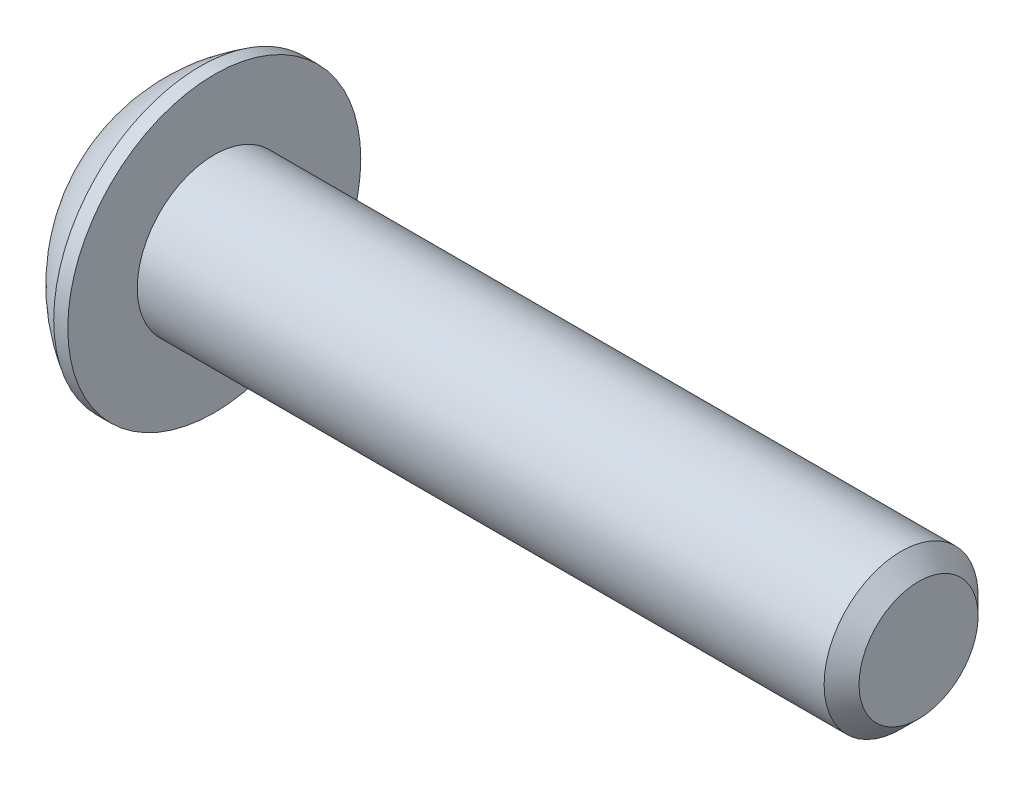
ISO-10303-21;
HEADER;
FILE_DESCRIPTION(('STEP AP214'),'2;1');
FILE_NAME('part.step','',(''),(''),'','','');
FILE_SCHEMA(('AUTOMOTIVE_DESIGN { 1 0 10303 214 1 1 1 1 }'));
ENDSEC;
DATA;
#1=APPLICATION_CONTEXT('core data for automotive mechanical design processes');
#2=APPLICATION_PROTOCOL_DEFINITION('international standard','automotive_design',2000,#1);
#3=PRODUCT_CONTEXT('',#1,'mechanical');
#4=PRODUCT('Part','Part','',(#3));
#5=PRODUCT_RELATED_PRODUCT_CATEGORY('part','',(#4));
#6=PRODUCT_DEFINITION_FORMATION('','',#4);
#7=PRODUCT_DEFINITION_CONTEXT('part definition',#1,'design');
#8=PRODUCT_DEFINITION('design','',#6,#7);
#9=PRODUCT_DEFINITION_SHAPE('','',#8);
#10=(LENGTH_UNIT() NAMED_UNIT(*) SI_UNIT(.MILLI.,.METRE.));
#11=(NAMED_UNIT(*) PLANE_ANGLE_UNIT() SI_UNIT($,.RADIAN.));
#12=(NAMED_UNIT(*) SI_UNIT($,.STERADIAN.) SOLID_ANGLE_UNIT());
#13=UNCERTAINTY_MEASURE_WITH_UNIT(LENGTH_MEASURE(1.E-05),#10,'distance_accuracy_value','');
#14=(GEOMETRIC_REPRESENTATION_CONTEXT(3) GLOBAL_UNCERTAINTY_ASSIGNED_CONTEXT((#13)) GLOBAL_UNIT_ASSIGNED_CONTEXT((#10,
#11,#12)) REPRESENTATION_CONTEXT('',''));
#15=CARTESIAN_POINT('',(0.,0.,0.));
#16=DIRECTION('',(0.,0.,1.));
#17=DIRECTION('',(1.,0.,0.));
#18=AXIS2_PLACEMENT_3D('',#15,#16,#17);
#19=CARTESIAN_POINT('',(1.32080000000034,0.,0.));
#20=DIRECTION('',(-1.,0.,0.));
#21=DIRECTION('',(0.,0.,1.));
#22=AXIS2_PLACEMENT_3D('',#19,#20,#21);
#23=CONICAL_SURFACE('',#22,1.1937999999998,1.04719755119608);
#24=CARTESIAN_POINT('',(2.01004075135902,0.,4.44089209850063E-13));
#25=VERTEX_POINT('',#24);
#26=VERTEX_LOOP('',#25);
#27=FACE_BOUND('',#26,.T.);
#28=CARTESIAN_POINT('',(1.32080000000009,0.,0.));
#29=DIRECTION('',(-1.,0.,0.));
#30=DIRECTION('',(0.,0.,1.));
#31=AXIS2_PLACEMENT_3D('',#28,#29,#30);
#32=CIRCLE('',#31,1.19380000000024);
#33=CARTESIAN_POINT('',(1.32080000000004,-1.03386112703797,0.59690000000006));
#34=VERTEX_POINT('',#33);
#35=CARTESIAN_POINT('',(1.32080000000004,0.,1.19380000000012));
#36=VERTEX_POINT('',#35);
#37=EDGE_CURVE('E18',#34,#36,#32,.T.);
#38=ORIENTED_EDGE('',*,*,#37,.T.);
#39=CARTESIAN_POINT('',(1.32080000000009,0.,0.));
#40=DIRECTION('',(-1.,0.,0.));
#41=DIRECTION('',(0.,0.,1.));
#42=AXIS2_PLACEMENT_3D('',#39,#40,#41);
#43=CIRCLE('',#42,1.19380000000024);
#44=CARTESIAN_POINT('',(1.32080000000004,1.03386112703797,0.596900000000061));
#45=VERTEX_POINT('',#44);
#46=EDGE_CURVE('E146',#36,#45,#43,.T.);
#47=ORIENTED_EDGE('',*,*,#46,.T.);
#48=CARTESIAN_POINT('',(1.32080000000009,0.,0.));
#49=DIRECTION('',(-1.,0.,0.));
#50=DIRECTION('',(0.,0.,1.));
#51=AXIS2_PLACEMENT_3D('',#48,#49,#50);
#52=CIRCLE('',#51,1.19380000000024);
#53=CARTESIAN_POINT('',(1.32080000000004,1.03386112703797,-0.596900000000061));
#54=VERTEX_POINT('',#53);
#55=EDGE_CURVE('E316',#45,#54,#52,.T.);
#56=ORIENTED_EDGE('',*,*,#55,.T.);
#57=CARTESIAN_POINT('',(1.32080000000009,0.,0.));
#58=DIRECTION('',(-1.,0.,0.));
#59=DIRECTION('',(0.,0.,1.));
#60=AXIS2_PLACEMENT_3D('',#57,#58,#59);
#61=CIRCLE('',#60,1.19380000000024);
#62=CARTESIAN_POINT('',(1.32080000000004,1.49457637585666E-12,-1.19380000000012));
#63=VERTEX_POINT('',#62);
#64=EDGE_CURVE('E317',#54,#63,#61,.T.);
#65=ORIENTED_EDGE('',*,*,#64,.T.);
#66=CARTESIAN_POINT('',(1.32080000000009,0.,0.));
#67=DIRECTION('',(-1.,0.,0.));
#68=DIRECTION('',(0.,0.,1.));
#69=AXIS2_PLACEMENT_3D('',#66,#67,#68);
#70=CIRCLE('',#69,1.19380000000024);
#71=CARTESIAN_POINT('',(1.32080000000004,-1.03386112703797,-0.59690000000006));
#72=VERTEX_POINT('',#71);
#73=EDGE_CURVE('E91',#63,#72,#70,.T.);
#74=ORIENTED_EDGE('',*,*,#73,.T.);
#75=CARTESIAN_POINT('',(1.32080000000009,0.,0.));
#76=DIRECTION('',(-1.,0.,0.));
#77=DIRECTION('',(0.,0.,1.));
#78=AXIS2_PLACEMENT_3D('',#75,#76,#77);
#79=CIRCLE('',#78,1.19380000000024);
#80=EDGE_CURVE('E87',#72,#34,#79,.T.);
#81=ORIENTED_EDGE('',*,*,#80,.T.);
#82=EDGE_LOOP('',(#38,#47,#56,#65,#74,#81));
#83=FACE_BOUND('',#82,.T.);
#84=ADVANCED_FACE('F15',(#27,#83),#23,.F.);
#85=CARTESIAN_POINT('',(1.3208,-2.06772225407572,-1.1938));
#86=DIRECTION('',(1.,0.,0.));
#87=DIRECTION('',(0.,0.,-1.));
#88=AXIS2_PLACEMENT_3D('',#85,#86,#87);
#89=PLANE('',#88);
#90=DIRECTION('',(0.,0.5,0.866025403784439));
#91=VECTOR('',#90,1.);
#92=CARTESIAN_POINT('',(1.3208,-1.37848150271715,0.));
#93=LINE('',#92,#91);
#94=CARTESIAN_POINT('',(1.3208,-0.689240751358574,1.1938));
#95=VERTEX_POINT('',#94);
#96=EDGE_CURVE('E99',#95,#34,#93,.F.);
#97=ORIENTED_EDGE('',*,*,#96,.F.);
#98=DIRECTION('',(0.,1.,0.));
#99=VECTOR('',#98,1.);
#100=CARTESIAN_POINT('',(1.3208,-0.689240751358574,1.1938));
#101=LINE('',#100,#99);
#102=EDGE_CURVE('E101',#36,#95,#101,.F.);
#103=ORIENTED_EDGE('',*,*,#102,.F.);
#104=ORIENTED_EDGE('',*,*,#37,.F.);
#105=EDGE_LOOP('',(#97,#103,#104));
#106=FACE_BOUND('',#105,.T.);
#107=ADVANCED_FACE('F97',(#106),#89,.F.);
#108=CARTESIAN_POINT('',(1.3208,-2.06772225407572,-1.1938));
#109=DIRECTION('',(1.,0.,0.));
#110=DIRECTION('',(0.,0.,-1.));
#111=AXIS2_PLACEMENT_3D('',#108,#109,#110);
#112=PLANE('',#111);
#113=DIRECTION('',(0.,-0.5,0.866025403784439));
#114=VECTOR('',#113,1.);
#115=CARTESIAN_POINT('',(1.3208,-0.689240751358574,-1.1938));
#116=LINE('',#115,#114);
#117=CARTESIAN_POINT('',(1.3208,-1.37848150271715,0.));
#118=VERTEX_POINT('',#117);
#119=EDGE_CURVE('E107',#118,#72,#116,.F.);
#120=ORIENTED_EDGE('',*,*,#119,.F.);
#121=DIRECTION('',(0.,0.5,0.866025403784439));
#122=VECTOR('',#121,1.);
#123=CARTESIAN_POINT('',(1.3208,-1.37848150271715,0.));
#124=LINE('',#123,#122);
#125=EDGE_CURVE('E104',#34,#118,#124,.F.);
#126=ORIENTED_EDGE('',*,*,#125,.F.);
#127=ORIENTED_EDGE('',*,*,#80,.F.);
#128=EDGE_LOOP('',(#120,#126,#127));
#129=FACE_BOUND('',#128,.T.);
#130=ADVANCED_FACE('F105',(#129),#112,.F.);
#131=CARTESIAN_POINT('',(1.3208,-2.06772225407572,-1.1938));
#132=DIRECTION('',(1.,0.,0.));
#133=DIRECTION('',(0.,0.,-1.));
#134=AXIS2_PLACEMENT_3D('',#131,#132,#133);
#135=PLANE('',#134);
#136=DIRECTION('',(0.,1.,0.));
#137=VECTOR('',#136,1.);
#138=CARTESIAN_POINT('',(1.3208,0.689240751358577,-1.1938));
#139=LINE('',#138,#137);
#140=CARTESIAN_POINT('',(1.3208,-0.689240751358574,-1.1938));
#141=VERTEX_POINT('',#140);
#142=EDGE_CURVE('E286',#141,#63,#139,.T.);
#143=ORIENTED_EDGE('',*,*,#142,.F.);
#144=DIRECTION('',(0.,-0.5,0.866025403784439));
#145=VECTOR('',#144,1.);
#146=CARTESIAN_POINT('',(1.3208,-0.689240751358574,-1.1938));
#147=LINE('',#146,#145);
#148=EDGE_CURVE('E298',#72,#141,#147,.F.);
#149=ORIENTED_EDGE('',*,*,#148,.F.);
#150=ORIENTED_EDGE('',*,*,#73,.F.);
#151=EDGE_LOOP('',(#143,#149,#150));
#152=FACE_BOUND('',#151,.T.);
#153=ADVANCED_FACE('F189',(#152),#135,.F.);
#154=CARTESIAN_POINT('',(1.3208,-2.06772225407572,-1.1938));
#155=DIRECTION('',(1.,0.,0.));
#156=DIRECTION('',(0.,0.,-1.));
#157=AXIS2_PLACEMENT_3D('',#154,#155,#156);
#158=PLANE('',#157);
#159=DIRECTION('',(0.,-0.5,-0.866025403784439));
#160=VECTOR('',#159,1.);
#161=CARTESIAN_POINT('',(1.3208,1.37848150271715,0.));
#162=LINE('',#161,#160);
#163=CARTESIAN_POINT('',(1.3208,0.689240751358577,-1.1938));
#164=VERTEX_POINT('',#163);
#165=EDGE_CURVE('E272',#164,#54,#162,.F.);
#166=ORIENTED_EDGE('',*,*,#165,.F.);
#167=DIRECTION('',(0.,1.,0.));
#168=VECTOR('',#167,1.);
#169=CARTESIAN_POINT('',(1.3208,0.689240751358577,-1.1938));
#170=LINE('',#169,#168);
#171=EDGE_CURVE('E283',#63,#164,#170,.T.);
#172=ORIENTED_EDGE('',*,*,#171,.F.);
#173=ORIENTED_EDGE('',*,*,#64,.F.);
#174=EDGE_LOOP('',(#166,#172,#173));
#175=FACE_BOUND('',#174,.T.);
#176=ADVANCED_FACE('F185',(#175),#158,.F.);
#177=CARTESIAN_POINT('',(1.3208,-2.06772225407572,-1.1938));
#178=DIRECTION('',(1.,0.,0.));
#179=DIRECTION('',(0.,0.,-1.));
#180=AXIS2_PLACEMENT_3D('',#177,#178,#179);
#181=PLANE('',#180);
#182=DIRECTION('',(0.,0.5,-0.866025403784439));
#183=VECTOR('',#182,1.);
#184=CARTESIAN_POINT('',(1.3208,0.689240751358576,1.1938));
#185=LINE('',#184,#183);
#186=CARTESIAN_POINT('',(1.3208,1.37848150271715,0.));
#187=VERTEX_POINT('',#186);
#188=EDGE_CURVE('E251',#187,#45,#185,.F.);
#189=ORIENTED_EDGE('',*,*,#188,.F.);
#190=DIRECTION('',(0.,-0.5,-0.866025403784439));
#191=VECTOR('',#190,1.);
#192=CARTESIAN_POINT('',(1.3208,1.37848150271715,0.));
#193=LINE('',#192,#191);
#194=EDGE_CURVE('E270',#54,#187,#193,.F.);
#195=ORIENTED_EDGE('',*,*,#194,.F.);
#196=ORIENTED_EDGE('',*,*,#55,.F.);
#197=EDGE_LOOP('',(#189,#195,#196));
#198=FACE_BOUND('',#197,.T.);
#199=ADVANCED_FACE('F181',(#198),#181,.F.);
#200=CARTESIAN_POINT('',(1.3208,-2.06772225407572,-1.1938));
#201=DIRECTION('',(1.,0.,0.));
#202=DIRECTION('',(0.,0.,-1.));
#203=AXIS2_PLACEMENT_3D('',#200,#201,#202);
#204=PLANE('',#203);
#205=DIRECTION('',(0.,1.,0.));
#206=VECTOR('',#205,1.);
#207=CARTESIAN_POINT('',(1.3208,-0.689240751358574,1.1938));
#208=LINE('',#207,#206);
#209=CARTESIAN_POINT('',(1.3208,0.689240751358576,1.1938));
#210=VERTEX_POINT('',#209);
#211=EDGE_CURVE('E116',#210,#36,#208,.F.);
#212=ORIENTED_EDGE('',*,*,#211,.F.);
#213=DIRECTION('',(0.,0.5,-0.866025403784439));
#214=VECTOR('',#213,1.);
#215=CARTESIAN_POINT('',(1.3208,0.689240751358576,1.1938));
#216=LINE('',#215,#214);
#217=EDGE_CURVE('E254',#45,#210,#216,.F.);
#218=ORIENTED_EDGE('',*,*,#217,.F.);
#219=ORIENTED_EDGE('',*,*,#46,.F.);
#220=EDGE_LOOP('',(#212,#218,#219));
#221=FACE_BOUND('',#220,.T.);
#222=ADVANCED_FACE('F177',(#221),#204,.F.);
#223=CARTESIAN_POINT('',(1.3208,-0.689240751358574,1.1938));
#224=DIRECTION('',(0.,0.,-1.));
#225=DIRECTION('',(0.,1.,0.));
#226=AXIS2_PLACEMENT_3D('',#223,#224,#225);
#227=PLANE('',#226);
#228=DIRECTION('',(0.,1.,0.));
#229=VECTOR('',#228,1.);
#230=CARTESIAN_POINT('',(0.,0.,1.1938));
#231=LINE('',#230,#229);
#232=CARTESIAN_POINT('',(0.,0.689240751358577,1.1938));
#233=VERTEX_POINT('',#232);
#234=CARTESIAN_POINT('',(0.,-0.689240751358574,1.1938));
#235=VERTEX_POINT('',#234);
#236=EDGE_CURVE('E248',#233,#235,#231,.F.);
#237=ORIENTED_EDGE('',*,*,#236,.F.);
#238=DIRECTION('',(1.,0.,0.));
#239=VECTOR('',#238,1.);
#240=CARTESIAN_POINT('',(1.3208,0.689240751358576,1.1938));
#241=LINE('',#240,#239);
#242=EDGE_CURVE('E260',#210,#233,#241,.F.);
#243=ORIENTED_EDGE('',*,*,#242,.F.);
#244=ORIENTED_EDGE('',*,*,#211,.T.);
#245=ORIENTED_EDGE('',*,*,#102,.T.);
#246=DIRECTION('',(1.,0.,0.));
#247=VECTOR('',#246,1.);
#248=CARTESIAN_POINT('',(1.3208,-0.689240751358574,1.1938));
#249=LINE('',#248,#247);
#250=EDGE_CURVE('E110',#235,#95,#249,.T.);
#251=ORIENTED_EDGE('',*,*,#250,.F.);
#252=EDGE_LOOP('',(#237,#243,#244,#245,#251));
#253=FACE_BOUND('',#252,.T.);
#254=ADVANCED_FACE('F174',(#253),#227,.T.);
#255=CARTESIAN_POINT('',(1.3208,-1.37848150271715,0.));
#256=DIRECTION('',(0.,0.866025403784439,-0.5));
#257=DIRECTION('',(0.,0.5,0.866025403784439));
#258=AXIS2_PLACEMENT_3D('',#255,#256,#257);
#259=PLANE('',#258);
#260=DIRECTION('',(0.,-0.5,-0.866025403784439));
#261=VECTOR('',#260,1.);
#262=CARTESIAN_POINT('',(0.,-0.689240751358574,1.1938));
#263=LINE('',#262,#261);
#264=CARTESIAN_POINT('',(0.,-1.37848150271715,0.));
#265=VERTEX_POINT('',#264);
#266=EDGE_CURVE('E245',#235,#265,#263,.T.);
#267=ORIENTED_EDGE('',*,*,#266,.F.);
#268=ORIENTED_EDGE('',*,*,#250,.T.);
#269=ORIENTED_EDGE('',*,*,#96,.T.);
#270=ORIENTED_EDGE('',*,*,#125,.T.);
#271=DIRECTION('',(1.,0.,0.));
#272=VECTOR('',#271,1.);
#273=CARTESIAN_POINT('',(1.3208,-1.37848150271715,0.));
#274=LINE('',#273,#272);
#275=EDGE_CURVE('E295',#265,#118,#274,.T.);
#276=ORIENTED_EDGE('',*,*,#275,.F.);
#277=EDGE_LOOP('',(#267,#268,#269,#270,#276));
#278=FACE_BOUND('',#277,.T.);
#279=ADVANCED_FACE('F114',(#278),#259,.T.);
#280=CARTESIAN_POINT('',(1.3208,-0.689240751358574,-1.1938));
#281=DIRECTION('',(0.,0.866025403784439,0.5));
#282=DIRECTION('',(0.,-0.5,0.866025403784439));
#283=AXIS2_PLACEMENT_3D('',#280,#281,#282);
#284=PLANE('',#283);
#285=DIRECTION('',(0.,0.5,-0.866025403784439));
#286=VECTOR('',#285,1.);
#287=CARTESIAN_POINT('',(0.,-1.37848150271715,0.));
#288=LINE('',#287,#286);
#289=CARTESIAN_POINT('',(0.,-0.689240751358574,-1.1938));
#290=VERTEX_POINT('',#289);
#291=EDGE_CURVE('E242',#265,#290,#288,.T.);
#292=ORIENTED_EDGE('',*,*,#291,.F.);
#293=ORIENTED_EDGE('',*,*,#275,.T.);
#294=ORIENTED_EDGE('',*,*,#119,.T.);
#295=ORIENTED_EDGE('',*,*,#148,.T.);
#296=DIRECTION('',(1.,0.,0.));
#297=VECTOR('',#296,1.);
#298=CARTESIAN_POINT('',(1.3208,-0.689240751358574,-1.1938));
#299=LINE('',#298,#297);
#300=EDGE_CURVE('E280',#290,#141,#299,.T.);
#301=ORIENTED_EDGE('',*,*,#300,.F.);
#302=EDGE_LOOP('',(#292,#293,#294,#295,#301));
#303=FACE_BOUND('',#302,.T.);
#304=ADVANCED_FACE('F167',(#303),#284,.T.);
#305=CARTESIAN_POINT('',(1.3208,0.689240751358577,-1.1938));
#306=DIRECTION('',(0.,0.,1.));
#307=DIRECTION('',(1.,0.,0.));
#308=AXIS2_PLACEMENT_3D('',#305,#306,#307);
#309=PLANE('',#308);
#310=DIRECTION('',(0.,1.,0.));
#311=VECTOR('',#310,1.);
#312=CARTESIAN_POINT('',(0.,0.,-1.1938));
#313=LINE('',#312,#311);
#314=CARTESIAN_POINT('',(0.,0.689240751358577,-1.1938));
#315=VERTEX_POINT('',#314);
#316=EDGE_CURVE('E239',#290,#315,#313,.T.);
#317=ORIENTED_EDGE('',*,*,#316,.F.);
#318=ORIENTED_EDGE('',*,*,#300,.T.);
#319=ORIENTED_EDGE('',*,*,#142,.T.);
#320=ORIENTED_EDGE('',*,*,#171,.T.);
#321=DIRECTION('',(1.,0.,0.));
#322=VECTOR('',#321,1.);
#323=CARTESIAN_POINT('',(1.3208,0.689240751358577,-1.1938));
#324=LINE('',#323,#322);
#325=EDGE_CURVE('E255',#315,#164,#324,.T.);
#326=ORIENTED_EDGE('',*,*,#325,.F.);
#327=EDGE_LOOP('',(#317,#318,#319,#320,#326));
#328=FACE_BOUND('',#327,.T.);
#329=ADVANCED_FACE('F164',(#328),#309,.T.);
#330=CARTESIAN_POINT('',(1.3208,1.37848150271715,0.));
#331=DIRECTION('',(0.,-0.866025403784439,0.5));
#332=DIRECTION('',(0.,-0.5,-0.866025403784439));
#333=AXIS2_PLACEMENT_3D('',#330,#331,#332);
#334=PLANE('',#333);
#335=DIRECTION('',(0.,0.5,0.866025403784439));
#336=VECTOR('',#335,1.);
#337=CARTESIAN_POINT('',(0.,0.689240751358577,-1.1938));
#338=LINE('',#337,#336);
#339=CARTESIAN_POINT('',(0.,1.37848150271715,0.));
#340=VERTEX_POINT('',#339);
#341=EDGE_CURVE('E236',#315,#340,#338,.T.);
#342=ORIENTED_EDGE('',*,*,#341,.F.);
#343=ORIENTED_EDGE('',*,*,#325,.T.);
#344=ORIENTED_EDGE('',*,*,#165,.T.);
#345=ORIENTED_EDGE('',*,*,#194,.T.);
#346=DIRECTION('',(1.,0.,0.));
#347=VECTOR('',#346,1.);
#348=CARTESIAN_POINT('',(1.3208,1.37848150271715,0.));
#349=LINE('',#348,#347);
#350=EDGE_CURVE('E33',#340,#187,#349,.T.);
#351=ORIENTED_EDGE('',*,*,#350,.F.);
#352=EDGE_LOOP('',(#342,#343,#344,#345,#351));
#353=FACE_BOUND('',#352,.T.);
#354=ADVANCED_FACE('F160',(#353),#334,.T.);
#355=CARTESIAN_POINT('',(1.3208,0.689240751358576,1.1938));
#356=DIRECTION('',(0.,-0.866025403784439,-0.5));
#357=DIRECTION('',(0.,0.5,-0.866025403784439));
#358=AXIS2_PLACEMENT_3D('',#355,#356,#357);
#359=PLANE('',#358);
#360=DIRECTION('',(0.,-0.5,0.866025403784439));
#361=VECTOR('',#360,1.);
#362=CARTESIAN_POINT('',(0.,1.37848150271715,0.));
#363=LINE('',#362,#361);
#364=EDGE_CURVE('E145',#340,#233,#363,.T.);
#365=ORIENTED_EDGE('',*,*,#364,.F.);
#366=ORIENTED_EDGE('',*,*,#350,.T.);
#367=ORIENTED_EDGE('',*,*,#188,.T.);
#368=ORIENTED_EDGE('',*,*,#217,.T.);
#369=ORIENTED_EDGE('',*,*,#242,.T.);
#370=EDGE_LOOP('',(#365,#366,#367,#368,#369));
#371=FACE_BOUND('',#370,.T.);
#372=ADVANCED_FACE('F156',(#371),#359,.T.);
#373=CARTESIAN_POINT('',(0.,0.,0.));
#374=DIRECTION('',(-1.,0.,0.));
#375=DIRECTION('',(0.,0.,1.));
#376=AXIS2_PLACEMENT_3D('',#373,#374,#375);
#377=PLANE('',#376);
#378=ORIENTED_EDGE('',*,*,#341,.T.);
#379=ORIENTED_EDGE('',*,*,#364,.T.);
#380=ORIENTED_EDGE('',*,*,#236,.T.);
#381=ORIENTED_EDGE('',*,*,#266,.T.);
#382=ORIENTED_EDGE('',*,*,#291,.T.);
#383=ORIENTED_EDGE('',*,*,#316,.T.);
#384=EDGE_LOOP('',(#378,#379,#380,#381,#382,#383));
#385=FACE_BOUND('',#384,.T.);
#386=CARTESIAN_POINT('',(0.,1.9812,0.));
#387=CARTESIAN_POINT('',(0.,1.9811996664299,0.0556258831179428));
#388=CARTESIAN_POINT('',(0.,1.97885520380442,0.111261989398606));
#389=CARTESIAN_POINT('',(0.,1.96949260169541,0.222149719830458));
#390=CARTESIAN_POINT('',(0.,1.96247308239605,0.277401225602895));
#391=CARTESIAN_POINT('',(0.,1.94379192841038,0.387209508139747));
#392=CARTESIAN_POINT('',(-1.85325793235264E-13,1.93212292489526,0.441765039546365));
#393=CARTESIAN_POINT('',(1.86344214223505E-13,1.90422331175315,0.549729449347493));
#394=CARTESIAN_POINT('',(6.94543371897454E-13,1.88798900035338,0.603137359208869));
#395=CARTESIAN_POINT('',(1.15501975216981E-12,1.83266214476501,0.760839131321828));
#396=CARTESIAN_POINT('',(0.,1.78690023648845,0.862876433575429));
#397=CARTESIAN_POINT('',(0.,1.67887358150667,1.05780719540872));
#398=CARTESIAN_POINT('',(9.54193214892627E-13,1.6166082074585,1.15070030720801));
#399=CARTESIAN_POINT('',(5.94805591894675E-13,1.51224157140982,1.28116890915697));
#400=CARTESIAN_POINT('',(1.63221293851378E-13,1.4755970394354,1.32320451127026));
#401=CARTESIAN_POINT('',(-1.62196980336157E-13,1.39893832619713,1.40400288695709));
#402=CARTESIAN_POINT('',(0.,1.35892742784698,1.44276877695455));
#403=CARTESIAN_POINT('',(1.14362537325405E-13,1.23416504602197,1.55382272417904));
#404=CARTESIAN_POINT('',(0.,1.14466125559859,1.62089527952111));
#405=CARTESIAN_POINT('',(0.,0.955712144178167,1.7390221808118));
#406=CARTESIAN_POINT('',(0.,0.856267198233564,1.79007713076007));
#407=CARTESIAN_POINT('',(0.,0.650206345910843,1.87477637530954));
#408=CARTESIAN_POINT('',(0.,0.543590516134855,1.90842085586267));
#409=CARTESIAN_POINT('',(0.,0.326226155292018,1.95733039300656));
#410=CARTESIAN_POINT('',(0.,0.21547760215793,1.97259535144288));
#411=CARTESIAN_POINT('',(0.,-0.00701040587544639,1.98431697865418));
#412=CARTESIAN_POINT('',(0.,-0.118749860774734,1.98077364742917));
#413=CARTESIAN_POINT('',(0.,-0.340050178355485,1.95497485623825));
#414=CARTESIAN_POINT('',(0.,-0.449611052668255,1.93271949620218));
#415=CARTESIAN_POINT('',(0.,-0.663431110729174,1.87014138774523));
#416=CARTESIAN_POINT('',(0.,-0.76769023783852,1.82981844635272));
#417=CARTESIAN_POINT('',(0.,-0.968005760719347,1.73219968377096));
#418=CARTESIAN_POINT('',(0.,-1.0640618469811,1.6749032225164));
#419=CARTESIAN_POINT('',(0.,-1.19980276751283,1.57757371205873));
#420=CARTESIAN_POINT('',(0.,-1.24366557129213,1.54322665019466));
#421=CARTESIAN_POINT('',(0.,-1.32838995706696,1.47093063174264));
#422=CARTESIAN_POINT('',(0.,-1.36924860178706,1.43297823102439));
#423=CARTESIAN_POINT('',(0.,-1.48674671849223,1.31419842051173));
#424=CARTESIAN_POINT('',(0.,-1.55842832343237,1.22836221289311));
#425=CARTESIAN_POINT('',(0.,-1.6863396856475,1.04586168272493));
#426=CARTESIAN_POINT('',(0.,-1.7425700302488,0.949197771949774));
#427=CARTESIAN_POINT('',(0.,-1.8141614250401,0.798182600298684));
#428=CARTESIAN_POINT('',(0.,-1.83591780585875,0.746776203847791));
#429=CARTESIAN_POINT('',(0.,-1.87500754181092,0.642341081688636));
#430=CARTESIAN_POINT('',(0.,-1.89234447645404,0.589313708122847));
#431=CARTESIAN_POINT('',(0.,-1.92246053433554,0.482076273028395));
#432=CARTESIAN_POINT('',(0.,-1.93524685475118,0.42786822425751));
#433=CARTESIAN_POINT('',(0.,-1.95620937250494,0.318578151844611));
#434=CARTESIAN_POINT('',(0.,-1.96438692958147,0.263496390912872));
#435=CARTESIAN_POINT('',(0.,-1.97388528284653,0.173607715038558));
#436=CARTESIAN_POINT('',(0.,-1.97662743364426,0.138944718024998));
#437=CARTESIAN_POINT('',(0.,-1.98028489645283,0.0695224782567002));
#438=CARTESIAN_POINT('',(0.,-1.98120020846367,0.0347632355019631));
#439=CARTESIAN_POINT('',(0.,-1.9811996664299,-0.0556258831179437));
#440=CARTESIAN_POINT('',(0.,-1.97885520380442,-0.111261989398607));
#441=CARTESIAN_POINT('',(0.,-1.96949260169541,-0.222149719830459));
#442=CARTESIAN_POINT('',(0.,-1.96247308239605,-0.277401225602897));
#443=CARTESIAN_POINT('',(0.,-1.94379192841039,-0.387209508139749));
#444=CARTESIAN_POINT('',(-1.85269749640691E-13,-1.93212292489526,-0.441765039546367));
#445=CARTESIAN_POINT('',(1.86288125054388E-13,-1.90422331175315,-0.549729449347495));
#446=CARTESIAN_POINT('',(6.94525090263764E-13,-1.88798900035338,-0.603137359208872));
#447=CARTESIAN_POINT('',(1.15505622829081E-12,-1.83266214476501,-0.760839131321831));
#448=CARTESIAN_POINT('',(0.,-1.78690023648845,-0.862876433575431));
#449=CARTESIAN_POINT('',(0.,-1.67887358150667,-1.05780719540872));
#450=CARTESIAN_POINT('',(9.54248812869379E-13,-1.6166082074585,-1.15070030720801));
#451=CARTESIAN_POINT('',(5.94777756479239E-13,-1.51224157140982,-1.28116890915698));
#452=CARTESIAN_POINT('',(1.63138949183833E-13,-1.47559703943539,-1.32320451127027));
#453=CARTESIAN_POINT('',(-1.62114715061273E-13,-1.39893832619713,-1.40400288695709));
#454=CARTESIAN_POINT('',(0.,-1.35892742784699,-1.44276877695455));
#455=CARTESIAN_POINT('',(1.13760489124207E-13,-1.23416504602197,-1.55382272417904));
#456=CARTESIAN_POINT('',(0.,-1.14466125559859,-1.62089527952111));
#457=CARTESIAN_POINT('',(0.,-0.95571214417816,-1.73902218081179));
#458=CARTESIAN_POINT('',(0.,-0.856267198233559,-1.79007713076007));
#459=CARTESIAN_POINT('',(0.,-0.650206345910841,-1.87477637530954));
#460=CARTESIAN_POINT('',(0.,-0.543590516134854,-1.90842085586267));
#461=CARTESIAN_POINT('',(0.,-0.326226155292018,-1.95733039300657));
#462=CARTESIAN_POINT('',(0.,-0.215477602157929,-1.97259535144288));
#463=CARTESIAN_POINT('',(0.,0.0070104058754487,-1.98431697865418));
#464=CARTESIAN_POINT('',(0.,0.118749860774737,-1.98077364742916));
#465=CARTESIAN_POINT('',(0.,0.340050178355489,-1.95497485623824));
#466=CARTESIAN_POINT('',(0.,0.44961105266826,-1.93271949620218));
#467=CARTESIAN_POINT('',(0.,0.663431110729178,-1.87014138774524));
#468=CARTESIAN_POINT('',(0.,0.767690237838524,-1.82981844635272));
#469=CARTESIAN_POINT('',(0.,0.968005760719348,-1.73219968377096));
#470=CARTESIAN_POINT('',(0.,1.0640618469811,-1.67490322251639));
#471=CARTESIAN_POINT('',(0.,1.19980276751283,-1.57757371205873));
#472=CARTESIAN_POINT('',(0.,1.24366557129214,-1.54322665019465));
#473=CARTESIAN_POINT('',(0.,1.32838995706696,-1.47093063174263));
#474=CARTESIAN_POINT('',(0.,1.36924860178706,-1.43297823102439));
#475=CARTESIAN_POINT('',(0.,1.48674671849223,-1.31419842051172));
#476=CARTESIAN_POINT('',(0.,1.55842832343237,-1.22836221289311));
#477=CARTESIAN_POINT('',(0.,1.6863396856475,-1.04586168272492));
#478=CARTESIAN_POINT('',(0.,1.7425700302488,-0.949197771949768));
#479=CARTESIAN_POINT('',(0.,1.8141614250401,-0.798182600298677));
#480=CARTESIAN_POINT('',(0.,1.83591780585875,-0.746776203847785));
#481=CARTESIAN_POINT('',(0.,1.87500754181092,-0.64234108168863));
#482=CARTESIAN_POINT('',(0.,1.89234447645404,-0.589313708122841));
#483=CARTESIAN_POINT('',(0.,1.92246053433555,-0.482076273028389));
#484=CARTESIAN_POINT('',(0.,1.93524685475118,-0.427868224257505));
#485=CARTESIAN_POINT('',(0.,1.95620937250494,-0.318578151844605));
#486=CARTESIAN_POINT('',(0.,1.96438692958147,-0.263496390912866));
#487=CARTESIAN_POINT('',(0.,1.97388528284653,-0.173607715038553));
#488=CARTESIAN_POINT('',(0.,1.97662743364426,-0.138944718024994));
#489=CARTESIAN_POINT('',(0.,1.98028489645283,-0.0695224782566989));
#490=CARTESIAN_POINT('',(0.,1.98120020846367,-0.034763235501963));
#491=CARTESIAN_POINT('',(0.,1.9812,0.));
#492=B_SPLINE_CURVE_WITH_KNOTS('',3,(#386,#387,#388,#389,#390,#391,#392,#393,#394,#395,#396,
#397,#398,#399,#400,#401,#402,#403,#404,#405,#406,#407,#408,#409,#410,#411,#412,#413,#414,#415,
#416,#417,#418,#419,#420,#421,#422,#423,#424,#425,#426,#427,#428,#429,#430,#431,#432,#433,#434,
#435,#436,#437,#438,#439,#440,#441,#442,#443,#444,#445,#446,#447,#448,#449,#450,#451,#452,#453,
#454,#455,#456,#457,#458,#459,#460,#461,#462,#463,#464,#465,#466,#467,#468,#469,#470,#471,#472,
#473,#474,#475,#476,#477,#478,#479,#480,#481,#482,#483,#484,#485,#486,#487,#488,#489,#490,#491),
.UNSPECIFIED.,.T.,.F.,(4,2,2,2,2,2,2,2,2,2,2,2,2,2,2,2,2,2,2,2,2,2,2,2,2,2,2,2,2,2,2,2,2,2,2,2,
2,2,2,2,2,2,2,2,2,2,2,2,2,2,2,2,4),(0.,0.166845646007828,0.333740557374255,0.500901034367693,
0.668197445942386,1.00199278686282,1.33580081809885,1.50292354032982,1.6698851310853,
2.00370118900129,2.33750465770544,2.67130456115909,3.005106247238,3.33890793331696,
3.67270783677065,4.00651130547476,4.34032736339026,4.50728895414554,4.67441167637632,
5.00821970761259,5.34201504853332,5.50931146010827,5.67647193710191,5.84336684846844,
6.0102124944764,6.11448220058334,6.21875190669029,6.38559755269812,6.55249246406454,
6.71965294105798,6.88694935263268,7.22074469355311,7.55455272478915,7.72167544702011,
7.88863703777559,8.22245309569158,8.55625656439573,8.89005646784938,9.2238581539283,
9.55765984000725,9.89145974346094,10.2252632121651,10.5590792700806,10.7260408608358,
10.8931635830666,11.2269716143029,11.5607669552236,11.7280633667986,11.8952238437922,
12.0621187551587,12.2289644011667,12.3332341072736,12.4375038133806),.UNSPECIFIED.);
#493=CARTESIAN_POINT('',(0.,1.9812,0.));
#494=VERTEX_POINT('',#493);
#495=EDGE_CURVE('E138',#494,#494,#492,.T.);
#496=ORIENTED_EDGE('',*,*,#495,.F.);
#497=EDGE_LOOP('',(#496));
#498=FACE_BOUND('',#497,.T.);
#499=ADVANCED_FACE('F152',(#385,#498),#377,.T.);
#500=CARTESIAN_POINT('',(4.13385,0.,0.));
#501=DIRECTION('',(0.,1.,0.));
#502=DIRECTION('',(1.,0.,0.));
#503=AXIS2_PLACEMENT_3D('',#500,#501,#502);
#504=SPHERICAL_SURFACE('',#503,4.58408870578439);
#505=CARTESIAN_POINT('',(1.8288,0.,0.));
#506=DIRECTION('',(-1.,0.,0.));
#507=DIRECTION('',(0.,0.,1.));
#508=AXIS2_PLACEMENT_3D('',#505,#506,#507);
#509=CIRCLE('',#508,3.9624);
#510=CARTESIAN_POINT('',(1.8288,0.,3.9624));
#511=VERTEX_POINT('',#510);
#512=EDGE_CURVE('E135',#511,#511,#509,.F.);
#513=ORIENTED_EDGE('',*,*,#512,.F.);
#514=EDGE_LOOP('',(#513));
#515=FACE_BOUND('',#514,.T.);
#516=ORIENTED_EDGE('',*,*,#495,.T.);
#517=EDGE_LOOP('',(#516));
#518=FACE_BOUND('',#517,.T.);
#519=ADVANCED_FACE('F148',(#515,#518),#504,.T.);
#520=CARTESIAN_POINT('',(21.2598,0.,0.));
#521=DIRECTION('',(-1.,0.,0.));
#522=DIRECTION('',(0.,0.,1.));
#523=AXIS2_PLACEMENT_3D('',#520,#521,#522);
#524=PLANE('',#523);
#525=CARTESIAN_POINT('',(21.2597999999389,0.,0.));
#526=DIRECTION('',(-1.,0.,0.));
#527=DIRECTION('',(0.,0.,1.));
#528=AXIS2_PLACEMENT_3D('',#525,#526,#527);
#529=CIRCLE('',#528,1.61036000002923);
#530=CARTESIAN_POINT('',(21.2597999999389,0.,1.61036000002923));
#531=VERTEX_POINT('',#530);
#532=EDGE_CURVE('E132',#531,#531,#529,.T.);
#533=ORIENTED_EDGE('',*,*,#532,.F.);
#534=EDGE_LOOP('',(#533));
#535=FACE_BOUND('',#534,.T.);
#536=ADVANCED_FACE('F220',(#535),#524,.F.);
#537=CARTESIAN_POINT('',(0.,0.,0.));
#538=DIRECTION('',(-1.,0.,0.));
#539=DIRECTION('',(0.,0.,1.));
#540=AXIS2_PLACEMENT_3D('',#537,#538,#539);
#541=CYLINDRICAL_SURFACE('',#540,3.9624);
#542=ORIENTED_EDGE('',*,*,#512,.T.);
#543=EDGE_LOOP('',(#542));
#544=FACE_BOUND('',#543,.T.);
#545=CARTESIAN_POINT('',(2.2098,0.,0.));
#546=DIRECTION('',(-1.,0.,0.));
#547=DIRECTION('',(0.,0.,1.));
#548=AXIS2_PLACEMENT_3D('',#545,#546,#547);
#549=CIRCLE('',#548,3.9624);
#550=CARTESIAN_POINT('',(2.2098,0.,3.9624));
#551=VERTEX_POINT('',#550);
#552=EDGE_CURVE('E129',#551,#551,#549,.T.);
#553=ORIENTED_EDGE('',*,*,#552,.T.);
#554=EDGE_LOOP('',(#553));
#555=FACE_BOUND('',#554,.T.);
#556=ADVANCED_FACE('F217',(#544,#555),#541,.T.);
#557=CARTESIAN_POINT('',(20.7873600000426,0.,0.));
#558=DIRECTION('',(-1.,0.,0.));
#559=DIRECTION('',(0.,0.,1.));
#560=AXIS2_PLACEMENT_3D('',#557,#558,#559);
#561=CONICAL_SURFACE('',#560,2.08279999992556,0.785398163397448);
#562=ORIENTED_EDGE('',*,*,#532,.T.);
#563=EDGE_LOOP('',(#562));
#564=FACE_BOUND('',#563,.T.);
#565=CARTESIAN_POINT('',(20.78736,0.,0.));
#566=DIRECTION('',(-1.,0.,0.));
#567=DIRECTION('',(0.,0.,1.));
#568=AXIS2_PLACEMENT_3D('',#565,#566,#567);
#569=CIRCLE('',#568,2.0828);
#570=CARTESIAN_POINT('',(20.78736,0.,2.0828));
#571=VERTEX_POINT('',#570);
#572=EDGE_CURVE('E24',#571,#571,#569,.T.);
#573=ORIENTED_EDGE('',*,*,#572,.F.);
#574=EDGE_LOOP('',(#573));
#575=FACE_BOUND('',#574,.T.);
#576=ADVANCED_FACE('F209',(#564,#575),#561,.T.);
#577=CARTESIAN_POINT('',(2.2098,2.0828,0.));
#578=DIRECTION('',(-1.,0.,0.));
#579=DIRECTION('',(0.,0.,1.));
#580=AXIS2_PLACEMENT_3D('',#577,#578,#579);
#581=PLANE('',#580);
#582=CARTESIAN_POINT('',(2.2098,0.,0.));
#583=DIRECTION('',(-1.,0.,0.));
#584=DIRECTION('',(0.,0.,1.));
#585=AXIS2_PLACEMENT_3D('',#582,#583,#584);
#586=CIRCLE('',#585,2.0828);
#587=CARTESIAN_POINT('',(2.2098,0.,2.0828));
#588=VERTEX_POINT('',#587);
#589=EDGE_CURVE('E10',#588,#588,#586,.F.);
#590=ORIENTED_EDGE('',*,*,#589,.F.);
#591=EDGE_LOOP('',(#590));
#592=FACE_BOUND('',#591,.T.);
#593=ORIENTED_EDGE('',*,*,#552,.F.);
#594=EDGE_LOOP('',(#593));
#595=FACE_BOUND('',#594,.T.);
#596=ADVANCED_FACE('F203',(#592,#595),#581,.F.);
#597=CARTESIAN_POINT('',(0.,0.,0.));
#598=DIRECTION('',(-1.,0.,0.));
#599=DIRECTION('',(0.,0.,1.));
#600=AXIS2_PLACEMENT_3D('',#597,#598,#599);
#601=CYLINDRICAL_SURFACE('',#600,2.0828);
#602=ORIENTED_EDGE('',*,*,#572,.T.);
#603=EDGE_LOOP('',(#602));
#604=FACE_BOUND('',#603,.T.);
#605=ORIENTED_EDGE('',*,*,#589,.T.);
#606=EDGE_LOOP('',(#605));
#607=FACE_BOUND('',#606,.T.);
#608=ADVANCED_FACE('F201',(#604,#607),#601,.T.);
#609=CLOSED_SHELL('',(#84,#107,#130,#153,#176,#199,#222,#254,#279,#304,#329,#354,#372,#499,#519,
#536,#556,#576,#596,#608));
#610=MANIFOLD_SOLID_BREP('B1',#609);
#611=ADVANCED_BREP_SHAPE_REPRESENTATION('',(#18,#610),#14);
#612=SHAPE_DEFINITION_REPRESENTATION(#9,#611);
ENDSEC;
END-ISO-10303-21;
